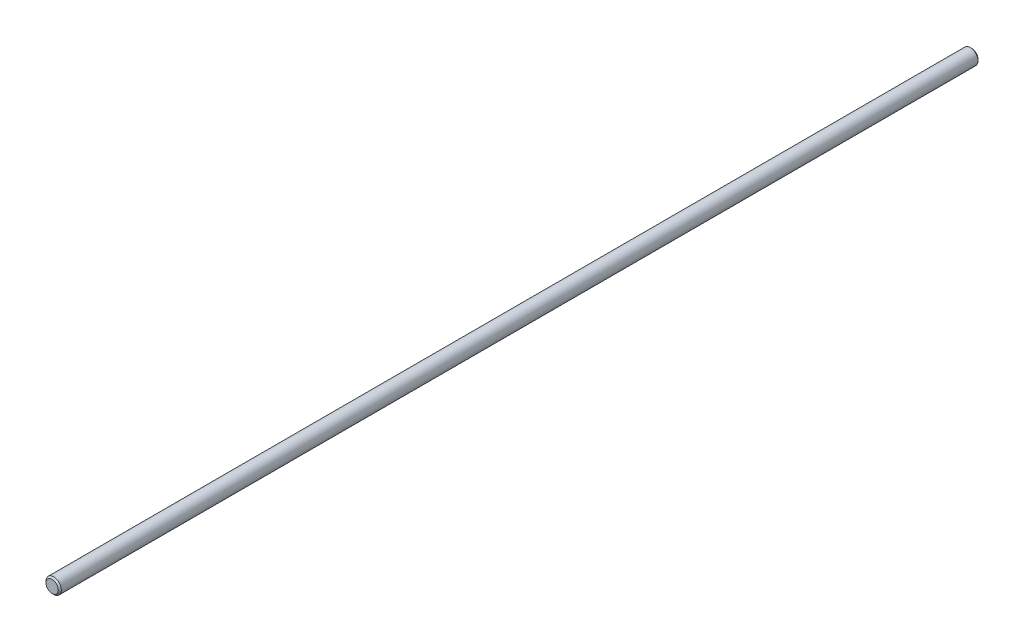
ISO-10303-21;
HEADER;
FILE_DESCRIPTION(('STEP AP214'),'2;1');
FILE_NAME('part.step','',(''),(''),'','','');
FILE_SCHEMA(('AUTOMOTIVE_DESIGN { 1 0 10303 214 1 1 1 1 }'));
ENDSEC;
DATA;
#1=APPLICATION_CONTEXT('core data for automotive mechanical design processes');
#2=APPLICATION_PROTOCOL_DEFINITION('international standard','automotive_design',2000,#1);
#3=PRODUCT_CONTEXT('',#1,'mechanical');
#4=PRODUCT('Part','Part','',(#3));
#5=PRODUCT_RELATED_PRODUCT_CATEGORY('part','',(#4));
#6=PRODUCT_DEFINITION_FORMATION('','',#4);
#7=PRODUCT_DEFINITION_CONTEXT('part definition',#1,'design');
#8=PRODUCT_DEFINITION('design','',#6,#7);
#9=PRODUCT_DEFINITION_SHAPE('','',#8);
#10=(LENGTH_UNIT() NAMED_UNIT(*) SI_UNIT(.MILLI.,.METRE.));
#11=(NAMED_UNIT(*) PLANE_ANGLE_UNIT() SI_UNIT($,.RADIAN.));
#12=(NAMED_UNIT(*) SI_UNIT($,.STERADIAN.) SOLID_ANGLE_UNIT());
#13=UNCERTAINTY_MEASURE_WITH_UNIT(LENGTH_MEASURE(1.E-05),#10,'distance_accuracy_value','');
#14=(GEOMETRIC_REPRESENTATION_CONTEXT(3) GLOBAL_UNCERTAINTY_ASSIGNED_CONTEXT((#13)) GLOBAL_UNIT_ASSIGNED_CONTEXT((#10,
#11,#12)) REPRESENTATION_CONTEXT('',''));
#15=CARTESIAN_POINT('',(0.,0.,0.));
#16=DIRECTION('',(0.,0.,1.));
#17=DIRECTION('',(1.,0.,0.));
#18=AXIS2_PLACEMENT_3D('',#15,#16,#17);
#19=CARTESIAN_POINT('',(0.,0.,-300.));
#20=DIRECTION('',(0.,0.,1.));
#21=DIRECTION('',(1.,0.,0.));
#22=AXIS2_PLACEMENT_3D('',#19,#20,#21);
#23=CYLINDRICAL_SURFACE('',#22,2.5);
#24=CARTESIAN_POINT('',(0.,0.,-299.5));
#25=DIRECTION('',(0.,0.,1.));
#26=DIRECTION('',(1.,0.,0.));
#27=AXIS2_PLACEMENT_3D('',#24,#25,#26);
#28=CIRCLE('',#27,2.5);
#29=CARTESIAN_POINT('',(2.5,0.,-299.5));
#30=VERTEX_POINT('',#29);
#31=EDGE_CURVE('E45',#30,#30,#28,.T.);
#32=ORIENTED_EDGE('',*,*,#31,.T.);
#33=EDGE_LOOP('',(#32));
#34=FACE_BOUND('',#33,.T.);
#35=CARTESIAN_POINT('',(0.,0.,-0.5));
#36=DIRECTION('',(0.,0.,1.));
#37=DIRECTION('',(1.,0.,0.));
#38=AXIS2_PLACEMENT_3D('',#35,#36,#37);
#39=CIRCLE('',#38,2.5);
#40=CARTESIAN_POINT('',(2.5,0.,-0.5));
#41=VERTEX_POINT('',#40);
#42=EDGE_CURVE('E49',#41,#41,#39,.F.);
#43=ORIENTED_EDGE('',*,*,#42,.T.);
#44=EDGE_LOOP('',(#43));
#45=FACE_BOUND('',#44,.T.);
#46=ADVANCED_FACE('F34',(#34,#45),#23,.T.);
#47=CARTESIAN_POINT('',(0.,0.,-300.));
#48=DIRECTION('',(0.,0.,1.));
#49=DIRECTION('',(1.,0.,0.));
#50=AXIS2_PLACEMENT_3D('',#47,#48,#49);
#51=PLANE('',#50);
#52=CARTESIAN_POINT('',(0.,0.,-300.));
#53=DIRECTION('',(0.,0.,1.));
#54=DIRECTION('',(1.,0.,0.));
#55=AXIS2_PLACEMENT_3D('',#52,#53,#54);
#56=CIRCLE('',#55,2.00000000000003);
#57=CARTESIAN_POINT('',(2.00000000000003,0.,-300.));
#58=VERTEX_POINT('',#57);
#59=EDGE_CURVE('E41',#58,#58,#56,.F.);
#60=ORIENTED_EDGE('',*,*,#59,.T.);
#61=EDGE_LOOP('',(#60));
#62=FACE_BOUND('',#61,.T.);
#63=ADVANCED_FACE('F65',(#62),#51,.F.);
#64=CARTESIAN_POINT('',(0.,0.,0.));
#65=DIRECTION('',(0.,0.,1.));
#66=DIRECTION('',(1.,0.,0.));
#67=AXIS2_PLACEMENT_3D('',#64,#65,#66);
#68=PLANE('',#67);
#69=CARTESIAN_POINT('',(0.,0.,0.));
#70=DIRECTION('',(0.,0.,1.));
#71=DIRECTION('',(1.,0.,0.));
#72=AXIS2_PLACEMENT_3D('',#69,#70,#71);
#73=CIRCLE('',#72,1.99999999999997);
#74=CARTESIAN_POINT('',(1.99999999999997,0.,0.));
#75=VERTEX_POINT('',#74);
#76=EDGE_CURVE('E10',#75,#75,#73,.T.);
#77=ORIENTED_EDGE('',*,*,#76,.T.);
#78=EDGE_LOOP('',(#77));
#79=FACE_BOUND('',#78,.T.);
#80=ADVANCED_FACE('F62',(#79),#68,.T.);
#81=CARTESIAN_POINT('',(0.,0.,-299.5));
#82=DIRECTION('',(0.,0.,1.));
#83=DIRECTION('',(1.,0.,0.));
#84=AXIS2_PLACEMENT_3D('',#81,#82,#83);
#85=CONICAL_SURFACE('',#84,2.5,0.785398163397529);
#86=ORIENTED_EDGE('',*,*,#59,.F.);
#87=EDGE_LOOP('',(#86));
#88=FACE_BOUND('',#87,.T.);
#89=ORIENTED_EDGE('',*,*,#31,.F.);
#90=EDGE_LOOP('',(#89));
#91=FACE_BOUND('',#90,.T.);
#92=ADVANCED_FACE('F58',(#88,#91),#85,.T.);
#93=CARTESIAN_POINT('',(0.,0.,0.));
#94=DIRECTION('',(0.,0.,-1.));
#95=DIRECTION('',(-1.,0.,0.));
#96=AXIS2_PLACEMENT_3D('',#93,#94,#95);
#97=CONICAL_SURFACE('',#96,1.99999999999997,0.785398163397474);
#98=ORIENTED_EDGE('',*,*,#42,.F.);
#99=EDGE_LOOP('',(#98));
#100=FACE_BOUND('',#99,.T.);
#101=ORIENTED_EDGE('',*,*,#76,.F.);
#102=EDGE_LOOP('',(#101));
#103=FACE_BOUND('',#102,.T.);
#104=ADVANCED_FACE('F36',(#100,#103),#97,.T.);
#105=CLOSED_SHELL('',(#46,#63,#80,#92,#104));
#106=MANIFOLD_SOLID_BREP('B2',#105);
#107=ADVANCED_BREP_SHAPE_REPRESENTATION('',(#18,#106),#14);
#108=SHAPE_DEFINITION_REPRESENTATION(#9,#107);
ENDSEC;
END-ISO-10303-21;
